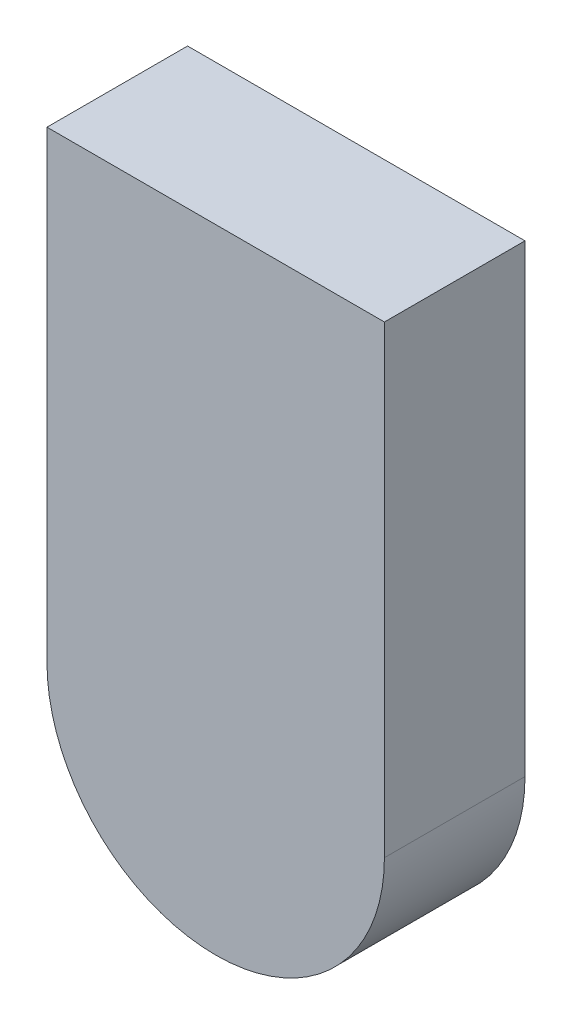
ISO-10303-21;
HEADER;
FILE_DESCRIPTION(('STEP AP214'),'2;1');
FILE_NAME('part.step','',(''),(''),'','','');
FILE_SCHEMA(('AUTOMOTIVE_DESIGN { 1 0 10303 214 1 1 1 1 }'));
ENDSEC;
DATA;
#1=APPLICATION_CONTEXT('core data for automotive mechanical design processes');
#2=APPLICATION_PROTOCOL_DEFINITION('international standard','automotive_design',2000,#1);
#3=PRODUCT_CONTEXT('',#1,'mechanical');
#4=PRODUCT('Part','Part','',(#3));
#5=PRODUCT_RELATED_PRODUCT_CATEGORY('part','',(#4));
#6=PRODUCT_DEFINITION_FORMATION('','',#4);
#7=PRODUCT_DEFINITION_CONTEXT('part definition',#1,'design');
#8=PRODUCT_DEFINITION('design','',#6,#7);
#9=PRODUCT_DEFINITION_SHAPE('','',#8);
#10=(LENGTH_UNIT() NAMED_UNIT(*) SI_UNIT(.MILLI.,.METRE.));
#11=(NAMED_UNIT(*) PLANE_ANGLE_UNIT() SI_UNIT($,.RADIAN.));
#12=(NAMED_UNIT(*) SI_UNIT($,.STERADIAN.) SOLID_ANGLE_UNIT());
#13=UNCERTAINTY_MEASURE_WITH_UNIT(LENGTH_MEASURE(1.E-05),#10,'distance_accuracy_value','');
#14=(GEOMETRIC_REPRESENTATION_CONTEXT(3) GLOBAL_UNCERTAINTY_ASSIGNED_CONTEXT((#13)) GLOBAL_UNIT_ASSIGNED_CONTEXT((#10,
#11,#12)) REPRESENTATION_CONTEXT('',''));
#15=CARTESIAN_POINT('',(0.,0.,0.));
#16=DIRECTION('',(0.,0.,1.));
#17=DIRECTION('',(1.,0.,0.));
#18=AXIS2_PLACEMENT_3D('',#15,#16,#17);
#19=CARTESIAN_POINT('',(-0.87,4.05,0.));
#20=DIRECTION('',(0.,1.,0.));
#21=DIRECTION('',(1.,0.,0.));
#22=AXIS2_PLACEMENT_3D('',#19,#20,#21);
#23=PLANE('',#22);
#24=DIRECTION('',(0.,0.,1.));
#25=VECTOR('',#24,1.);
#26=CARTESIAN_POINT('',(-0.87,4.05,0.));
#27=LINE('',#26,#25);
#28=CARTESIAN_POINT('',(-0.87,4.05,0.));
#29=VERTEX_POINT('',#28);
#30=CARTESIAN_POINT('',(-0.87,4.05,0.1));
#31=VERTEX_POINT('',#30);
#32=EDGE_CURVE('E11',#29,#31,#27,.T.);
#33=ORIENTED_EDGE('',*,*,#32,.T.);
#34=DIRECTION('',(1.,0.,0.));
#35=VECTOR('',#34,1.);
#36=CARTESIAN_POINT('',(-0.87,4.05,0.1));
#37=LINE('',#36,#35);
#38=CARTESIAN_POINT('',(-0.63,4.05,0.1));
#39=VERTEX_POINT('',#38);
#40=EDGE_CURVE('E24',#31,#39,#37,.T.);
#41=ORIENTED_EDGE('',*,*,#40,.T.);
#42=DIRECTION('',(0.,0.,1.));
#43=VECTOR('',#42,1.);
#44=CARTESIAN_POINT('',(-0.63,4.05,0.));
#45=LINE('',#44,#43);
#46=CARTESIAN_POINT('',(-0.63,4.05,0.));
#47=VERTEX_POINT('',#46);
#48=EDGE_CURVE('E85',#47,#39,#45,.T.);
#49=ORIENTED_EDGE('',*,*,#48,.F.);
#50=DIRECTION('',(1.,0.,0.));
#51=VECTOR('',#50,1.);
#52=CARTESIAN_POINT('',(-0.87,4.05,0.));
#53=LINE('',#52,#51);
#54=EDGE_CURVE('E82',#29,#47,#53,.T.);
#55=ORIENTED_EDGE('',*,*,#54,.F.);
#56=EDGE_LOOP('',(#33,#41,#49,#55));
#57=FACE_BOUND('',#56,.T.);
#58=ADVANCED_FACE('F17',(#57),#23,.T.);
#59=CARTESIAN_POINT('',(-0.63,4.05,0.));
#60=DIRECTION('',(1.,0.,0.));
#61=DIRECTION('',(0.,-1.,0.));
#62=AXIS2_PLACEMENT_3D('',#59,#60,#61);
#63=PLANE('',#62);
#64=ORIENTED_EDGE('',*,*,#48,.T.);
#65=DIRECTION('',(0.,-1.,0.));
#66=VECTOR('',#65,1.);
#67=CARTESIAN_POINT('',(-0.63,4.05,0.1));
#68=LINE('',#67,#66);
#69=CARTESIAN_POINT('',(-0.63,3.72,0.1));
#70=VERTEX_POINT('',#69);
#71=EDGE_CURVE('E80',#39,#70,#68,.T.);
#72=ORIENTED_EDGE('',*,*,#71,.T.);
#73=DIRECTION('',(0.,0.,1.));
#74=VECTOR('',#73,1.);
#75=CARTESIAN_POINT('',(-0.63,3.72,0.));
#76=LINE('',#75,#74);
#77=CARTESIAN_POINT('',(-0.63,3.72,0.));
#78=VERTEX_POINT('',#77);
#79=EDGE_CURVE('E60',#78,#70,#76,.T.);
#80=ORIENTED_EDGE('',*,*,#79,.F.);
#81=DIRECTION('',(0.,-1.,0.));
#82=VECTOR('',#81,1.);
#83=CARTESIAN_POINT('',(-0.63,4.05,0.));
#84=LINE('',#83,#82);
#85=EDGE_CURVE('E76',#47,#78,#84,.T.);
#86=ORIENTED_EDGE('',*,*,#85,.F.);
#87=EDGE_LOOP('',(#64,#72,#80,#86));
#88=FACE_BOUND('',#87,.T.);
#89=ADVANCED_FACE('F89',(#88),#63,.T.);
#90=CARTESIAN_POINT('',(-0.75,3.72,0.));
#91=DIRECTION('',(0.,0.,-1.));
#92=DIRECTION('',(1.,0.,0.));
#93=AXIS2_PLACEMENT_3D('',#90,#91,#92);
#94=CYLINDRICAL_SURFACE('',#93,0.12);
#95=CARTESIAN_POINT('',(-0.75,3.72,0.));
#96=DIRECTION('',(0.,0.,1.));
#97=DIRECTION('',(1.,0.,0.));
#98=AXIS2_PLACEMENT_3D('',#95,#96,#97);
#99=CIRCLE('',#98,0.12);
#100=CARTESIAN_POINT('',(-0.87,3.72,0.));
#101=VERTEX_POINT('',#100);
#102=EDGE_CURVE('E64',#101,#78,#99,.T.);
#103=ORIENTED_EDGE('',*,*,#102,.T.);
#104=ORIENTED_EDGE('',*,*,#79,.T.);
#105=CARTESIAN_POINT('',(-0.75,3.72,0.1));
#106=DIRECTION('',(0.,0.,1.));
#107=DIRECTION('',(1.,0.,0.));
#108=AXIS2_PLACEMENT_3D('',#105,#106,#107);
#109=CIRCLE('',#108,0.12);
#110=CARTESIAN_POINT('',(-0.87,3.72,0.1));
#111=VERTEX_POINT('',#110);
#112=EDGE_CURVE('E55',#111,#70,#109,.T.);
#113=ORIENTED_EDGE('',*,*,#112,.F.);
#114=DIRECTION('',(0.,0.,1.));
#115=VECTOR('',#114,1.);
#116=CARTESIAN_POINT('',(-0.87,3.72,0.));
#117=LINE('',#116,#115);
#118=EDGE_CURVE('E59',#101,#111,#117,.T.);
#119=ORIENTED_EDGE('',*,*,#118,.F.);
#120=EDGE_LOOP('',(#103,#104,#113,#119));
#121=FACE_BOUND('',#120,.T.);
#122=ADVANCED_FACE('F58',(#121),#94,.T.);
#123=CARTESIAN_POINT('',(-0.87,4.05,0.));
#124=DIRECTION('',(1.,0.,0.));
#125=DIRECTION('',(0.,-1.,0.));
#126=AXIS2_PLACEMENT_3D('',#123,#124,#125);
#127=PLANE('',#126);
#128=DIRECTION('',(0.,-1.,0.));
#129=VECTOR('',#128,1.);
#130=CARTESIAN_POINT('',(-0.87,4.05,0.));
#131=LINE('',#130,#129);
#132=EDGE_CURVE('E69',#29,#101,#131,.T.);
#133=ORIENTED_EDGE('',*,*,#132,.T.);
#134=ORIENTED_EDGE('',*,*,#118,.T.);
#135=DIRECTION('',(0.,-1.,0.));
#136=VECTOR('',#135,1.);
#137=CARTESIAN_POINT('',(-0.87,4.05,0.1));
#138=LINE('',#137,#136);
#139=EDGE_CURVE('E67',#31,#111,#138,.T.);
#140=ORIENTED_EDGE('',*,*,#139,.F.);
#141=ORIENTED_EDGE('',*,*,#32,.F.);
#142=EDGE_LOOP('',(#133,#134,#140,#141));
#143=FACE_BOUND('',#142,.T.);
#144=ADVANCED_FACE('F66',(#143),#127,.F.);
#145=CARTESIAN_POINT('',(-0.75,3.849490847913,0.));
#146=DIRECTION('',(0.,0.,-1.));
#147=DIRECTION('',(-1.,0.,0.));
#148=AXIS2_PLACEMENT_3D('',#145,#146,#147);
#149=PLANE('',#148);
#150=ORIENTED_EDGE('',*,*,#54,.T.);
#151=ORIENTED_EDGE('',*,*,#85,.T.);
#152=ORIENTED_EDGE('',*,*,#102,.F.);
#153=ORIENTED_EDGE('',*,*,#132,.F.);
#154=EDGE_LOOP('',(#150,#151,#152,#153));
#155=FACE_BOUND('',#154,.T.);
#156=ADVANCED_FACE('F91',(#155),#149,.T.);
#157=CARTESIAN_POINT('',(-0.75,3.849490847913,0.1));
#158=DIRECTION('',(0.,0.,-1.));
#159=DIRECTION('',(-1.,0.,0.));
#160=AXIS2_PLACEMENT_3D('',#157,#158,#159);
#161=PLANE('',#160);
#162=ORIENTED_EDGE('',*,*,#139,.T.);
#163=ORIENTED_EDGE('',*,*,#112,.T.);
#164=ORIENTED_EDGE('',*,*,#71,.F.);
#165=ORIENTED_EDGE('',*,*,#40,.F.);
#166=EDGE_LOOP('',(#162,#163,#164,#165));
#167=FACE_BOUND('',#166,.T.);
#168=ADVANCED_FACE('F71',(#167),#161,.F.);
#169=CLOSED_SHELL('',(#58,#89,#122,#144,#156,#168));
#170=MANIFOLD_SOLID_BREP('B1',#169);
#171=ADVANCED_BREP_SHAPE_REPRESENTATION('',(#18,#170),#14);
#172=SHAPE_DEFINITION_REPRESENTATION(#9,#171);
ENDSEC;
END-ISO-10303-21;
